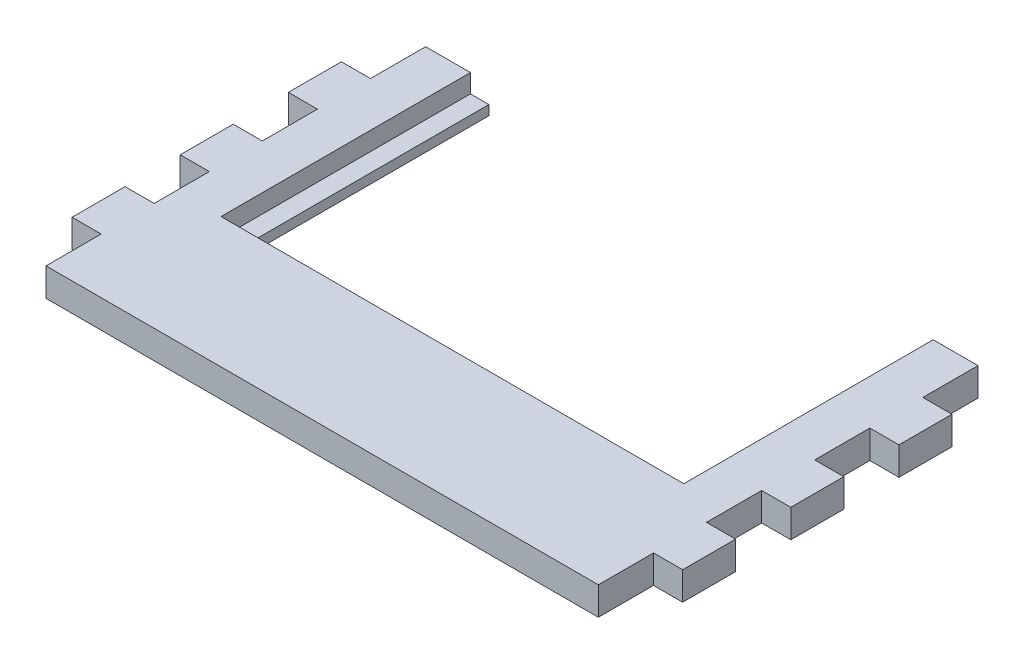
ISO-10303-21;
HEADER;
FILE_DESCRIPTION(('STEP AP214'),'2;1');
FILE_NAME('part.step','',(''),(''),'','','');
FILE_SCHEMA(('AUTOMOTIVE_DESIGN { 1 0 10303 214 1 1 1 1 }'));
ENDSEC;
DATA;
#1=APPLICATION_CONTEXT('core data for automotive mechanical design processes');
#2=APPLICATION_PROTOCOL_DEFINITION('international standard','automotive_design',2000,#1);
#3=PRODUCT_CONTEXT('',#1,'mechanical');
#4=PRODUCT('Part','Part','',(#3));
#5=PRODUCT_RELATED_PRODUCT_CATEGORY('part','',(#4));
#6=PRODUCT_DEFINITION_FORMATION('','',#4);
#7=PRODUCT_DEFINITION_CONTEXT('part definition',#1,'design');
#8=PRODUCT_DEFINITION('design','',#6,#7);
#9=PRODUCT_DEFINITION_SHAPE('','',#8);
#10=(LENGTH_UNIT() NAMED_UNIT(*) SI_UNIT(.MILLI.,.METRE.));
#11=(NAMED_UNIT(*) PLANE_ANGLE_UNIT() SI_UNIT($,.RADIAN.));
#12=(NAMED_UNIT(*) SI_UNIT($,.STERADIAN.) SOLID_ANGLE_UNIT());
#13=UNCERTAINTY_MEASURE_WITH_UNIT(LENGTH_MEASURE(1.E-05),#10,'distance_accuracy_value','');
#14=(GEOMETRIC_REPRESENTATION_CONTEXT(3) GLOBAL_UNCERTAINTY_ASSIGNED_CONTEXT((#13)) GLOBAL_UNIT_ASSIGNED_CONTEXT((#10,
#11,#12)) REPRESENTATION_CONTEXT('',''));
#15=CARTESIAN_POINT('',(0.,0.,0.));
#16=DIRECTION('',(0.,0.,1.));
#17=DIRECTION('',(1.,0.,0.));
#18=AXIS2_PLACEMENT_3D('',#15,#16,#17);
#19=CARTESIAN_POINT('',(0.,15.25,-185.313864628821));
#20=DIRECTION('',(0.,0.,-1.));
#21=DIRECTION('',(-1.,0.,0.));
#22=AXIS2_PLACEMENT_3D('',#19,#20,#21);
#23=PLANE('',#22);
#24=DIRECTION('',(1.,0.,0.));
#25=VECTOR('',#24,1.);
#26=CARTESIAN_POINT('',(0.,15.25,-185.313864628821));
#27=LINE('',#26,#25);
#28=CARTESIAN_POINT('',(127.414847161572,15.25,-185.313864628821));
#29=VERTEX_POINT('',#28);
#30=CARTESIAN_POINT('',(151.664847161572,15.25,-185.313864628821));
#31=VERTEX_POINT('',#30);
#32=EDGE_CURVE('E294',#29,#31,#27,.T.);
#33=ORIENTED_EDGE('',*,*,#32,.T.);
#34=DIRECTION('',(0.,1.,0.));
#35=VECTOR('',#34,1.);
#36=CARTESIAN_POINT('',(151.664847161572,-0.000999999999999265,-185.313864628821));
#37=LINE('',#36,#35);
#38=CARTESIAN_POINT('',(151.664847161572,0.,-185.313864628821));
#39=VERTEX_POINT('',#38);
#40=EDGE_CURVE('E530',#39,#31,#37,.T.);
#41=ORIENTED_EDGE('',*,*,#40,.F.);
#42=DIRECTION('',(1.,0.,0.));
#43=VECTOR('',#42,1.);
#44=CARTESIAN_POINT('',(0.,0.,-185.313864628821));
#45=LINE('',#44,#43);
#46=CARTESIAN_POINT('',(117.414847161572,0.,-185.313864628821));
#47=VERTEX_POINT('',#46);
#48=EDGE_CURVE('E331',#47,#39,#45,.T.);
#49=ORIENTED_EDGE('',*,*,#48,.F.);
#50=DIRECTION('',(0.,-1.,0.));
#51=VECTOR('',#50,1.);
#52=CARTESIAN_POINT('',(117.414847161572,15.25,-185.313864628821));
#53=LINE('',#52,#51);
#54=CARTESIAN_POINT('',(117.414847161572,5.25,-185.313864628821));
#55=VERTEX_POINT('',#54);
#56=EDGE_CURVE('E11',#55,#47,#53,.T.);
#57=ORIENTED_EDGE('',*,*,#56,.F.);
#58=DIRECTION('',(-1.,0.,0.));
#59=VECTOR('',#58,1.);
#60=CARTESIAN_POINT('',(-123.085152838428,5.25,-185.313864628821));
#61=LINE('',#60,#59);
#62=CARTESIAN_POINT('',(127.414847161572,5.25,-185.313864628821));
#63=VERTEX_POINT('',#62);
#64=EDGE_CURVE('E359',#63,#55,#61,.T.);
#65=ORIENTED_EDGE('',*,*,#64,.F.);
#66=DIRECTION('',(0.,1.,0.));
#67=VECTOR('',#66,1.);
#68=CARTESIAN_POINT('',(127.414847161572,5.25,-185.313864628821));
#69=LINE('',#68,#67);
#70=EDGE_CURVE('E361',#63,#29,#69,.T.);
#71=ORIENTED_EDGE('',*,*,#70,.T.);
#72=EDGE_LOOP('',(#33,#41,#49,#57,#65,#71));
#73=FACE_BOUND('',#72,.T.);
#74=ADVANCED_FACE('F38',(#73),#23,.T.);
#75=CARTESIAN_POINT('',(0.,15.25,20.1861353711791));
#76=DIRECTION('',(0.,0.,-1.));
#77=DIRECTION('',(-1.,0.,0.));
#78=AXIS2_PLACEMENT_3D('',#75,#76,#77);
#79=PLANE('',#78);
#80=DIRECTION('',(0.,1.,0.));
#81=VECTOR('',#80,1.);
#82=CARTESIAN_POINT('',(151.664847161572,-0.000999999999999265,20.186135371179));
#83=LINE('',#82,#81);
#84=CARTESIAN_POINT('',(151.664847161572,0.,20.1861353711791));
#85=VERTEX_POINT('',#84);
#86=CARTESIAN_POINT('',(151.664847161572,15.25,20.186135371179));
#87=VERTEX_POINT('',#86);
#88=EDGE_CURVE('E466',#85,#87,#83,.T.);
#89=ORIENTED_EDGE('',*,*,#88,.T.);
#90=DIRECTION('',(1.,0.,0.));
#91=VECTOR('',#90,1.);
#92=CARTESIAN_POINT('',(0.,15.25,20.1861353711791));
#93=LINE('',#92,#91);
#94=CARTESIAN_POINT('',(-147.335152838428,15.25,20.1861353711791));
#95=VERTEX_POINT('',#94);
#96=EDGE_CURVE('E338',#95,#87,#93,.T.);
#97=ORIENTED_EDGE('',*,*,#96,.F.);
#98=DIRECTION('',(0.,1.,0.));
#99=VECTOR('',#98,1.);
#100=CARTESIAN_POINT('',(-147.335152838428,-0.000999999999999265,20.1861353711791));
#101=LINE('',#100,#99);
#102=CARTESIAN_POINT('',(-147.335152838428,0.,20.1861353711791));
#103=VERTEX_POINT('',#102);
#104=EDGE_CURVE('E385',#103,#95,#101,.T.);
#105=ORIENTED_EDGE('',*,*,#104,.F.);
#106=DIRECTION('',(1.,0.,0.));
#107=VECTOR('',#106,1.);
#108=CARTESIAN_POINT('',(0.,0.,20.1861353711791));
#109=LINE('',#108,#107);
#110=EDGE_CURVE('E305',#103,#85,#109,.T.);
#111=ORIENTED_EDGE('',*,*,#110,.T.);
#112=EDGE_LOOP('',(#89,#97,#105,#111));
#113=FACE_BOUND('',#112,.T.);
#114=ADVANCED_FACE('F622',(#113),#79,.F.);
#115=CARTESIAN_POINT('',(167.414847161572,15.25,0.));
#116=DIRECTION('',(1.,0.,0.));
#117=DIRECTION('',(0.,0.,-1.));
#118=AXIS2_PLACEMENT_3D('',#115,#116,#117);
#119=PLANE('',#118);
#120=DIRECTION('',(0.,0.,1.));
#121=VECTOR('',#120,1.);
#122=CARTESIAN_POINT('',(167.414847161572,0.,0.));
#123=LINE('',#122,#121);
#124=CARTESIAN_POINT('',(167.414847161572,0.,-155.456721771678));
#125=VERTEX_POINT('',#124);
#126=CARTESIAN_POINT('',(167.414847161572,0.,-126.766245581202));
#127=VERTEX_POINT('',#126);
#128=EDGE_CURVE('E286',#125,#127,#123,.T.);
#129=ORIENTED_EDGE('',*,*,#128,.F.);
#130=DIRECTION('',(0.,1.,0.));
#131=VECTOR('',#130,1.);
#132=CARTESIAN_POINT('',(167.414847161572,-0.000999999999999265,-155.456721771678));
#133=LINE('',#132,#131);
#134=CARTESIAN_POINT('',(167.414847161572,15.25,-155.456721771678));
#135=VERTEX_POINT('',#134);
#136=EDGE_CURVE('E269',#125,#135,#133,.T.);
#137=ORIENTED_EDGE('',*,*,#136,.T.);
#138=DIRECTION('',(0.,0.,1.));
#139=VECTOR('',#138,1.);
#140=CARTESIAN_POINT('',(167.414847161572,15.25,0.));
#141=LINE('',#140,#139);
#142=CARTESIAN_POINT('',(167.414847161572,15.25,-126.766245581202));
#143=VERTEX_POINT('',#142);
#144=EDGE_CURVE('E339',#135,#143,#141,.T.);
#145=ORIENTED_EDGE('',*,*,#144,.T.);
#146=DIRECTION('',(0.,1.,0.));
#147=VECTOR('',#146,1.);
#148=CARTESIAN_POINT('',(167.414847161572,-0.000999999999999265,-126.766245581202));
#149=LINE('',#148,#147);
#150=EDGE_CURVE('E293',#127,#143,#149,.T.);
#151=ORIENTED_EDGE('',*,*,#150,.F.);
#152=EDGE_LOOP('',(#129,#137,#145,#151));
#153=FACE_BOUND('',#152,.T.);
#154=ADVANCED_FACE('F292',(#153),#119,.T.);
#155=CARTESIAN_POINT('',(167.414847161572,0.,-96.9091027240591));
#156=VERTEX_POINT('',#155);
#157=CARTESIAN_POINT('',(167.414847161572,0.,-68.2186265335829));
#158=VERTEX_POINT('',#157);
#159=EDGE_CURVE('E295',#156,#158,#123,.T.);
#160=ORIENTED_EDGE('',*,*,#159,.F.);
#161=DIRECTION('',(0.,1.,0.));
#162=VECTOR('',#161,1.);
#163=CARTESIAN_POINT('',(167.414847161572,-0.000999999999999265,-96.9091027240591));
#164=LINE('',#163,#162);
#165=CARTESIAN_POINT('',(167.414847161572,15.25,-96.9091027240591));
#166=VERTEX_POINT('',#165);
#167=EDGE_CURVE('E509',#156,#166,#164,.T.);
#168=ORIENTED_EDGE('',*,*,#167,.T.);
#169=CARTESIAN_POINT('',(167.414847161572,15.25,-68.2186265335829));
#170=VERTEX_POINT('',#169);
#171=EDGE_CURVE('E337',#166,#170,#141,.T.);
#172=ORIENTED_EDGE('',*,*,#171,.T.);
#173=DIRECTION('',(0.,1.,0.));
#174=VECTOR('',#173,1.);
#175=CARTESIAN_POINT('',(167.414847161572,-0.000999999999999265,-68.2186265335829));
#176=LINE('',#175,#174);
#177=EDGE_CURVE('E486',#158,#170,#176,.T.);
#178=ORIENTED_EDGE('',*,*,#177,.F.);
#179=EDGE_LOOP('',(#160,#168,#172,#178));
#180=FACE_BOUND('',#179,.T.);
#181=ADVANCED_FACE('F648',(#180),#119,.T.);
#182=CARTESIAN_POINT('',(167.414847161572,0.,-38.36148367644));
#183=VERTEX_POINT('',#182);
#184=CARTESIAN_POINT('',(167.414847161572,0.,-9.67100748596383));
#185=VERTEX_POINT('',#184);
#186=EDGE_CURVE('E297',#183,#185,#123,.T.);
#187=ORIENTED_EDGE('',*,*,#186,.F.);
#188=DIRECTION('',(0.,1.,0.));
#189=VECTOR('',#188,1.);
#190=CARTESIAN_POINT('',(167.414847161572,-0.000999999999999265,-38.36148367644));
#191=LINE('',#190,#189);
#192=CARTESIAN_POINT('',(167.414847161572,15.25,-38.36148367644));
#193=VERTEX_POINT('',#192);
#194=EDGE_CURVE('E485',#183,#193,#191,.T.);
#195=ORIENTED_EDGE('',*,*,#194,.T.);
#196=CARTESIAN_POINT('',(167.414847161572,15.25,-9.67100748596383));
#197=VERTEX_POINT('',#196);
#198=EDGE_CURVE('E334',#193,#197,#141,.T.);
#199=ORIENTED_EDGE('',*,*,#198,.T.);
#200=DIRECTION('',(0.,1.,0.));
#201=VECTOR('',#200,1.);
#202=CARTESIAN_POINT('',(167.414847161572,-0.000999999999999265,-9.67100748596383));
#203=LINE('',#202,#201);
#204=EDGE_CURVE('E467',#185,#197,#203,.T.);
#205=ORIENTED_EDGE('',*,*,#204,.F.);
#206=EDGE_LOOP('',(#187,#195,#199,#205));
#207=FACE_BOUND('',#206,.T.);
#208=ADVANCED_FACE('F632',(#207),#119,.T.);
#209=CARTESIAN_POINT('',(0.,15.25,0.));
#210=DIRECTION('',(0.,1.,0.));
#211=DIRECTION('',(0.,0.,1.));
#212=AXIS2_PLACEMENT_3D('',#209,#210,#211);
#213=PLANE('',#212);
#214=ORIENTED_EDGE('',*,*,#144,.F.);
#215=DIRECTION('',(-1.,0.,0.));
#216=VECTOR('',#215,1.);
#217=CARTESIAN_POINT('',(167.414847161572,15.25,-155.456721771678));
#218=LINE('',#217,#216);
#219=CARTESIAN_POINT('',(151.664847161572,15.25,-155.456721771678));
#220=VERTEX_POINT('',#219);
#221=EDGE_CURVE('E275',#135,#220,#218,.T.);
#222=ORIENTED_EDGE('',*,*,#221,.T.);
#223=DIRECTION('',(0.,0.,-1.));
#224=VECTOR('',#223,1.);
#225=CARTESIAN_POINT('',(151.664847161572,15.25,-185.313864628821));
#226=LINE('',#225,#224);
#227=EDGE_CURVE('E289',#220,#31,#226,.T.);
#228=ORIENTED_EDGE('',*,*,#227,.T.);
#229=ORIENTED_EDGE('',*,*,#32,.F.);
#230=DIRECTION('',(0.,0.,-1.));
#231=VECTOR('',#230,1.);
#232=CARTESIAN_POINT('',(127.414847161572,15.25,-185.313864628821));
#233=LINE('',#232,#231);
#234=CARTESIAN_POINT('',(127.414847161572,15.25,-50.313864628821));
#235=VERTEX_POINT('',#234);
#236=EDGE_CURVE('E366',#235,#29,#233,.T.);
#237=ORIENTED_EDGE('',*,*,#236,.F.);
#238=DIRECTION('',(1.,0.,0.));
#239=VECTOR('',#238,1.);
#240=CARTESIAN_POINT('',(-123.085152838428,15.25,-50.3138646288209));
#241=LINE('',#240,#239);
#242=CARTESIAN_POINT('',(-123.085152838428,15.25,-50.3138646288209));
#243=VERTEX_POINT('',#242);
#244=EDGE_CURVE('E369',#243,#235,#241,.T.);
#245=ORIENTED_EDGE('',*,*,#244,.F.);
#246=DIRECTION('',(0.,0.,1.));
#247=VECTOR('',#246,1.);
#248=CARTESIAN_POINT('',(-123.085152838428,15.25,-185.313864628821));
#249=LINE('',#248,#247);
#250=CARTESIAN_POINT('',(-123.085152838428,15.25,-185.313864628821));
#251=VERTEX_POINT('',#250);
#252=EDGE_CURVE('E372',#251,#243,#249,.T.);
#253=ORIENTED_EDGE('',*,*,#252,.F.);
#254=CARTESIAN_POINT('',(-147.335152838428,15.25,-185.313864628821));
#255=VERTEX_POINT('',#254);
#256=EDGE_CURVE('E299',#255,#251,#27,.T.);
#257=ORIENTED_EDGE('',*,*,#256,.F.);
#258=DIRECTION('',(0.,0.,-1.));
#259=VECTOR('',#258,1.);
#260=CARTESIAN_POINT('',(-147.335152838428,15.25,-185.313864628821));
#261=LINE('',#260,#259);
#262=CARTESIAN_POINT('',(-147.335152838428,15.25,-155.456721771678));
#263=VERTEX_POINT('',#262);
#264=EDGE_CURVE('E454',#263,#255,#261,.T.);
#265=ORIENTED_EDGE('',*,*,#264,.F.);
#266=DIRECTION('',(1.,0.,0.));
#267=VECTOR('',#266,1.);
#268=CARTESIAN_POINT('',(-163.085152838428,15.25,-155.456721771678));
#269=LINE('',#268,#267);
#270=CARTESIAN_POINT('',(-163.085152838428,15.25,-155.456721771678));
#271=VERTEX_POINT('',#270);
#272=EDGE_CURVE('E459',#271,#263,#269,.T.);
#273=ORIENTED_EDGE('',*,*,#272,.F.);
#274=DIRECTION('',(0.,0.,1.));
#275=VECTOR('',#274,1.);
#276=CARTESIAN_POINT('',(-163.085152838428,15.25,0.));
#277=LINE('',#276,#275);
#278=CARTESIAN_POINT('',(-163.085152838428,15.25,-126.766245581202));
#279=VERTEX_POINT('',#278);
#280=EDGE_CURVE('E342',#271,#279,#277,.T.);
#281=ORIENTED_EDGE('',*,*,#280,.T.);
#282=DIRECTION('',(-1.,0.,0.));
#283=VECTOR('',#282,1.);
#284=CARTESIAN_POINT('',(-163.085152838428,15.25,-126.766245581202));
#285=LINE('',#284,#283);
#286=CARTESIAN_POINT('',(-147.335152838428,15.25,-126.766245581202));
#287=VERTEX_POINT('',#286);
#288=EDGE_CURVE('E432',#287,#279,#285,.T.);
#289=ORIENTED_EDGE('',*,*,#288,.F.);
#290=DIRECTION('',(0.,0.,-1.));
#291=VECTOR('',#290,1.);
#292=CARTESIAN_POINT('',(-147.335152838428,15.25,-126.766245581202));
#293=LINE('',#292,#291);
#294=CARTESIAN_POINT('',(-147.335152838428,15.25,-96.9091027240591));
#295=VERTEX_POINT('',#294);
#296=EDGE_CURVE('E439',#295,#287,#293,.T.);
#297=ORIENTED_EDGE('',*,*,#296,.F.);
#298=DIRECTION('',(1.,0.,0.));
#299=VECTOR('',#298,1.);
#300=CARTESIAN_POINT('',(-163.085152838428,15.25,-96.9091027240591));
#301=LINE('',#300,#299);
#302=CARTESIAN_POINT('',(-163.085152838428,15.25,-96.9091027240591));
#303=VERTEX_POINT('',#302);
#304=EDGE_CURVE('E442',#303,#295,#301,.T.);
#305=ORIENTED_EDGE('',*,*,#304,.F.);
#306=CARTESIAN_POINT('',(-163.085152838428,15.25,-68.2186265335828));
#307=VERTEX_POINT('',#306);
#308=EDGE_CURVE('E345',#303,#307,#277,.T.);
#309=ORIENTED_EDGE('',*,*,#308,.T.);
#310=DIRECTION('',(-1.,0.,0.));
#311=VECTOR('',#310,1.);
#312=CARTESIAN_POINT('',(-163.085152838428,15.25,-68.2186265335828));
#313=LINE('',#312,#311);
#314=CARTESIAN_POINT('',(-147.335152838428,15.25,-68.2186265335828));
#315=VERTEX_POINT('',#314);
#316=EDGE_CURVE('E408',#315,#307,#313,.T.);
#317=ORIENTED_EDGE('',*,*,#316,.F.);
#318=DIRECTION('',(0.,0.,-1.));
#319=VECTOR('',#318,1.);
#320=CARTESIAN_POINT('',(-147.335152838428,15.25,-68.2186265335828));
#321=LINE('',#320,#319);
#322=CARTESIAN_POINT('',(-147.335152838428,15.25,-38.36148367644));
#323=VERTEX_POINT('',#322);
#324=EDGE_CURVE('E415',#323,#315,#321,.T.);
#325=ORIENTED_EDGE('',*,*,#324,.F.);
#326=DIRECTION('',(1.,0.,0.));
#327=VECTOR('',#326,1.);
#328=CARTESIAN_POINT('',(-163.085152838428,15.25,-38.36148367644));
#329=LINE('',#328,#327);
#330=CARTESIAN_POINT('',(-163.085152838428,15.25,-38.36148367644));
#331=VERTEX_POINT('',#330);
#332=EDGE_CURVE('E418',#331,#323,#329,.T.);
#333=ORIENTED_EDGE('',*,*,#332,.F.);
#334=CARTESIAN_POINT('',(-163.085152838428,15.25,-9.67100748596383));
#335=VERTEX_POINT('',#334);
#336=EDGE_CURVE('E343',#331,#335,#277,.T.);
#337=ORIENTED_EDGE('',*,*,#336,.T.);
#338=DIRECTION('',(-1.,0.,0.));
#339=VECTOR('',#338,1.);
#340=CARTESIAN_POINT('',(-163.085152838428,15.25,-9.67100748596383));
#341=LINE('',#340,#339);
#342=CARTESIAN_POINT('',(-147.335152838428,15.25,-9.67100748596383));
#343=VERTEX_POINT('',#342);
#344=EDGE_CURVE('E388',#343,#335,#341,.T.);
#345=ORIENTED_EDGE('',*,*,#344,.F.);
#346=DIRECTION('',(0.,0.,-1.));
#347=VECTOR('',#346,1.);
#348=CARTESIAN_POINT('',(-147.335152838428,15.25,-9.67100748596383));
#349=LINE('',#348,#347);
#350=EDGE_CURVE('E395',#95,#343,#349,.T.);
#351=ORIENTED_EDGE('',*,*,#350,.F.);
#352=ORIENTED_EDGE('',*,*,#96,.T.);
#353=DIRECTION('',(0.,0.,-1.));
#354=VECTOR('',#353,1.);
#355=CARTESIAN_POINT('',(151.664847161572,15.25,-9.67100748596383));
#356=LINE('',#355,#354);
#357=CARTESIAN_POINT('',(151.664847161572,15.25,-9.67100748596383));
#358=VERTEX_POINT('',#357);
#359=EDGE_CURVE('E470',#87,#358,#356,.T.);
#360=ORIENTED_EDGE('',*,*,#359,.T.);
#361=DIRECTION('',(1.,0.,0.));
#362=VECTOR('',#361,1.);
#363=CARTESIAN_POINT('',(167.414847161572,15.25,-9.67100748596383));
#364=LINE('',#363,#362);
#365=EDGE_CURVE('E475',#358,#197,#364,.T.);
#366=ORIENTED_EDGE('',*,*,#365,.T.);
#367=ORIENTED_EDGE('',*,*,#198,.F.);
#368=DIRECTION('',(-1.,0.,0.));
#369=VECTOR('',#368,1.);
#370=CARTESIAN_POINT('',(167.414847161572,15.25,-38.36148367644));
#371=LINE('',#370,#369);
#372=CARTESIAN_POINT('',(151.664847161572,15.25,-38.36148367644));
#373=VERTEX_POINT('',#372);
#374=EDGE_CURVE('E489',#193,#373,#371,.T.);
#375=ORIENTED_EDGE('',*,*,#374,.T.);
#376=DIRECTION('',(0.,0.,-1.));
#377=VECTOR('',#376,1.);
#378=CARTESIAN_POINT('',(151.664847161572,15.25,-68.2186265335829));
#379=LINE('',#378,#377);
#380=CARTESIAN_POINT('',(151.664847161572,15.25,-68.2186265335829));
#381=VERTEX_POINT('',#380);
#382=EDGE_CURVE('E497',#373,#381,#379,.T.);
#383=ORIENTED_EDGE('',*,*,#382,.T.);
#384=DIRECTION('',(1.,0.,0.));
#385=VECTOR('',#384,1.);
#386=CARTESIAN_POINT('',(167.414847161572,15.25,-68.2186265335829));
#387=LINE('',#386,#385);
#388=EDGE_CURVE('E500',#381,#170,#387,.T.);
#389=ORIENTED_EDGE('',*,*,#388,.T.);
#390=ORIENTED_EDGE('',*,*,#171,.F.);
#391=DIRECTION('',(-1.,0.,0.));
#392=VECTOR('',#391,1.);
#393=CARTESIAN_POINT('',(167.414847161572,15.25,-96.9091027240591));
#394=LINE('',#393,#392);
#395=CARTESIAN_POINT('',(151.664847161572,15.25,-96.9091027240591));
#396=VERTEX_POINT('',#395);
#397=EDGE_CURVE('E511',#166,#396,#394,.T.);
#398=ORIENTED_EDGE('',*,*,#397,.T.);
#399=DIRECTION('',(0.,0.,-1.));
#400=VECTOR('',#399,1.);
#401=CARTESIAN_POINT('',(151.664847161572,15.25,-126.766245581202));
#402=LINE('',#401,#400);
#403=CARTESIAN_POINT('',(151.664847161572,15.25,-126.766245581202));
#404=VERTEX_POINT('',#403);
#405=EDGE_CURVE('E519',#396,#404,#402,.T.);
#406=ORIENTED_EDGE('',*,*,#405,.T.);
#407=DIRECTION('',(1.,0.,0.));
#408=VECTOR('',#407,1.);
#409=CARTESIAN_POINT('',(167.414847161572,15.25,-126.766245581202));
#410=LINE('',#409,#408);
#411=EDGE_CURVE('E522',#404,#143,#410,.T.);
#412=ORIENTED_EDGE('',*,*,#411,.T.);
#413=EDGE_LOOP('',(#214,#222,#228,#229,#237,#245,#253,#257,#265,#273,#281,#289,#297,#305,#309,
#317,#325,#333,#337,#345,#351,#352,#360,#366,#367,#375,#383,#389,#390,#398,#406,#412));
#414=FACE_BOUND('',#413,.T.);
#415=ADVANCED_FACE('F538',(#414),#213,.T.);
#416=CARTESIAN_POINT('',(0.,0.,0.));
#417=DIRECTION('',(0.,1.,0.));
#418=DIRECTION('',(0.,0.,1.));
#419=AXIS2_PLACEMENT_3D('',#416,#417,#418);
#420=PLANE('',#419);
#421=DIRECTION('',(1.,0.,0.));
#422=VECTOR('',#421,1.);
#423=CARTESIAN_POINT('',(167.414847161572,0.,-155.456721771678));
#424=LINE('',#423,#422);
#425=CARTESIAN_POINT('',(151.664847161572,0.,-155.456721771678));
#426=VERTEX_POINT('',#425);
#427=EDGE_CURVE('E272',#426,#125,#424,.T.);
#428=ORIENTED_EDGE('',*,*,#427,.T.);
#429=ORIENTED_EDGE('',*,*,#128,.T.);
#430=DIRECTION('',(-1.,0.,0.));
#431=VECTOR('',#430,1.);
#432=CARTESIAN_POINT('',(167.414847161572,0.,-126.766245581202));
#433=LINE('',#432,#431);
#434=CARTESIAN_POINT('',(151.664847161572,0.,-126.766245581202));
#435=VERTEX_POINT('',#434);
#436=EDGE_CURVE('E507',#127,#435,#433,.T.);
#437=ORIENTED_EDGE('',*,*,#436,.T.);
#438=DIRECTION('',(0.,0.,1.));
#439=VECTOR('',#438,1.);
#440=CARTESIAN_POINT('',(151.664847161572,0.,-126.766245581202));
#441=LINE('',#440,#439);
#442=CARTESIAN_POINT('',(151.664847161572,0.,-96.9091027240591));
#443=VERTEX_POINT('',#442);
#444=EDGE_CURVE('E484',#435,#443,#441,.T.);
#445=ORIENTED_EDGE('',*,*,#444,.T.);
#446=DIRECTION('',(1.,0.,0.));
#447=VECTOR('',#446,1.);
#448=CARTESIAN_POINT('',(167.414847161572,0.,-96.9091027240591));
#449=LINE('',#448,#447);
#450=EDGE_CURVE('E525',#443,#156,#449,.T.);
#451=ORIENTED_EDGE('',*,*,#450,.T.);
#452=ORIENTED_EDGE('',*,*,#159,.T.);
#453=DIRECTION('',(-1.,0.,0.));
#454=VECTOR('',#453,1.);
#455=CARTESIAN_POINT('',(167.414847161572,0.,-68.2186265335829));
#456=LINE('',#455,#454);
#457=CARTESIAN_POINT('',(151.664847161572,0.,-68.2186265335829));
#458=VERTEX_POINT('',#457);
#459=EDGE_CURVE('E481',#158,#458,#456,.T.);
#460=ORIENTED_EDGE('',*,*,#459,.T.);
#461=DIRECTION('',(0.,0.,1.));
#462=VECTOR('',#461,1.);
#463=CARTESIAN_POINT('',(151.664847161572,0.,-68.2186265335829));
#464=LINE('',#463,#462);
#465=CARTESIAN_POINT('',(151.664847161572,0.,-38.36148367644));
#466=VERTEX_POINT('',#465);
#467=EDGE_CURVE('E465',#458,#466,#464,.T.);
#468=ORIENTED_EDGE('',*,*,#467,.T.);
#469=DIRECTION('',(1.,0.,0.));
#470=VECTOR('',#469,1.);
#471=CARTESIAN_POINT('',(167.414847161572,0.,-38.36148367644));
#472=LINE('',#471,#470);
#473=EDGE_CURVE('E503',#466,#183,#472,.T.);
#474=ORIENTED_EDGE('',*,*,#473,.T.);
#475=ORIENTED_EDGE('',*,*,#186,.T.);
#476=DIRECTION('',(-1.,0.,0.));
#477=VECTOR('',#476,1.);
#478=CARTESIAN_POINT('',(167.414847161572,0.,-9.67100748596383));
#479=LINE('',#478,#477);
#480=CARTESIAN_POINT('',(151.664847161572,0.,-9.67100748596383));
#481=VERTEX_POINT('',#480);
#482=EDGE_CURVE('E463',#185,#481,#479,.T.);
#483=ORIENTED_EDGE('',*,*,#482,.T.);
#484=DIRECTION('',(0.,0.,1.));
#485=VECTOR('',#484,1.);
#486=CARTESIAN_POINT('',(151.664847161572,0.,-9.67100748596383));
#487=LINE('',#486,#485);
#488=EDGE_CURVE('E478',#481,#85,#487,.T.);
#489=ORIENTED_EDGE('',*,*,#488,.T.);
#490=ORIENTED_EDGE('',*,*,#110,.F.);
#491=DIRECTION('',(0.,0.,1.));
#492=VECTOR('',#491,1.);
#493=CARTESIAN_POINT('',(-147.335152838428,0.,-9.67100748596383));
#494=LINE('',#493,#492);
#495=CARTESIAN_POINT('',(-147.335152838428,0.,-9.67100748596383));
#496=VERTEX_POINT('',#495);
#497=EDGE_CURVE('E280',#496,#103,#494,.T.);
#498=ORIENTED_EDGE('',*,*,#497,.F.);
#499=DIRECTION('',(1.,0.,0.));
#500=VECTOR('',#499,1.);
#501=CARTESIAN_POINT('',(-163.085152838428,0.,-9.67100748596383));
#502=LINE('',#501,#500);
#503=CARTESIAN_POINT('',(-163.085152838428,0.,-9.67100748596383));
#504=VERTEX_POINT('',#503);
#505=EDGE_CURVE('E398',#504,#496,#502,.T.);
#506=ORIENTED_EDGE('',*,*,#505,.F.);
#507=DIRECTION('',(0.,0.,1.));
#508=VECTOR('',#507,1.);
#509=CARTESIAN_POINT('',(-163.085152838428,0.,0.));
#510=LINE('',#509,#508);
#511=CARTESIAN_POINT('',(-163.085152838428,0.,-38.36148367644));
#512=VERTEX_POINT('',#511);
#513=EDGE_CURVE('E318',#512,#504,#510,.T.);
#514=ORIENTED_EDGE('',*,*,#513,.F.);
#515=DIRECTION('',(-1.,0.,0.));
#516=VECTOR('',#515,1.);
#517=CARTESIAN_POINT('',(-163.085152838428,0.,-38.36148367644));
#518=LINE('',#517,#516);
#519=CARTESIAN_POINT('',(-147.335152838428,0.,-38.36148367644));
#520=VERTEX_POINT('',#519);
#521=EDGE_CURVE('E401',#520,#512,#518,.T.);
#522=ORIENTED_EDGE('',*,*,#521,.F.);
#523=DIRECTION('',(0.,0.,1.));
#524=VECTOR('',#523,1.);
#525=CARTESIAN_POINT('',(-147.335152838428,0.,-68.2186265335828));
#526=LINE('',#525,#524);
#527=CARTESIAN_POINT('',(-147.335152838428,0.,-68.2186265335828));
#528=VERTEX_POINT('',#527);
#529=EDGE_CURVE('E393',#528,#520,#526,.T.);
#530=ORIENTED_EDGE('',*,*,#529,.F.);
#531=DIRECTION('',(1.,0.,0.));
#532=VECTOR('',#531,1.);
#533=CARTESIAN_POINT('',(-163.085152838428,0.,-68.2186265335828));
#534=LINE('',#533,#532);
#535=CARTESIAN_POINT('',(-163.085152838428,0.,-68.2186265335828));
#536=VERTEX_POINT('',#535);
#537=EDGE_CURVE('E421',#536,#528,#534,.T.);
#538=ORIENTED_EDGE('',*,*,#537,.F.);
#539=CARTESIAN_POINT('',(-163.085152838428,0.,-96.9091027240591));
#540=VERTEX_POINT('',#539);
#541=EDGE_CURVE('E316',#540,#536,#510,.T.);
#542=ORIENTED_EDGE('',*,*,#541,.F.);
#543=DIRECTION('',(-1.,0.,0.));
#544=VECTOR('',#543,1.);
#545=CARTESIAN_POINT('',(-163.085152838428,0.,-96.9091027240591));
#546=LINE('',#545,#544);
#547=CARTESIAN_POINT('',(-147.335152838428,0.,-96.9091027240591));
#548=VERTEX_POINT('',#547);
#549=EDGE_CURVE('E425',#548,#540,#546,.T.);
#550=ORIENTED_EDGE('',*,*,#549,.F.);
#551=DIRECTION('',(0.,0.,1.));
#552=VECTOR('',#551,1.);
#553=CARTESIAN_POINT('',(-147.335152838428,0.,-126.766245581202));
#554=LINE('',#553,#552);
#555=CARTESIAN_POINT('',(-147.335152838428,0.,-126.766245581202));
#556=VERTEX_POINT('',#555);
#557=EDGE_CURVE('E403',#556,#548,#554,.T.);
#558=ORIENTED_EDGE('',*,*,#557,.F.);
#559=DIRECTION('',(1.,0.,0.));
#560=VECTOR('',#559,1.);
#561=CARTESIAN_POINT('',(-163.085152838428,0.,-126.766245581202));
#562=LINE('',#561,#560);
#563=CARTESIAN_POINT('',(-163.085152838428,0.,-126.766245581202));
#564=VERTEX_POINT('',#563);
#565=EDGE_CURVE('E445',#564,#556,#562,.T.);
#566=ORIENTED_EDGE('',*,*,#565,.F.);
#567=CARTESIAN_POINT('',(-163.085152838428,0.,-155.456721771678));
#568=VERTEX_POINT('',#567);
#569=EDGE_CURVE('E310',#568,#564,#510,.T.);
#570=ORIENTED_EDGE('',*,*,#569,.F.);
#571=DIRECTION('',(-1.,0.,0.));
#572=VECTOR('',#571,1.);
#573=CARTESIAN_POINT('',(-163.085152838428,0.,-155.456721771678));
#574=LINE('',#573,#572);
#575=CARTESIAN_POINT('',(-147.335152838428,0.,-155.456721771678));
#576=VERTEX_POINT('',#575);
#577=EDGE_CURVE('E374',#576,#568,#574,.T.);
#578=ORIENTED_EDGE('',*,*,#577,.F.);
#579=DIRECTION('',(0.,0.,1.));
#580=VECTOR('',#579,1.);
#581=CARTESIAN_POINT('',(-147.335152838428,0.,-185.313864628821));
#582=LINE('',#581,#580);
#583=CARTESIAN_POINT('',(-147.335152838428,0.,-185.313864628821));
#584=VERTEX_POINT('',#583);
#585=EDGE_CURVE('E427',#584,#576,#582,.T.);
#586=ORIENTED_EDGE('',*,*,#585,.F.);
#587=CARTESIAN_POINT('',(-113.085152838428,0.,-185.313864628821));
#588=VERTEX_POINT('',#587);
#589=EDGE_CURVE('E321',#584,#588,#45,.T.);
#590=ORIENTED_EDGE('',*,*,#589,.T.);
#591=DIRECTION('',(0.,0.,1.));
#592=VECTOR('',#591,1.);
#593=CARTESIAN_POINT('',(-113.085152838428,0.,0.));
#594=LINE('',#593,#592);
#595=CARTESIAN_POINT('',(-113.085152838428,0.,-60.3138646288209));
#596=VERTEX_POINT('',#595);
#597=EDGE_CURVE('E322',#588,#596,#594,.T.);
#598=ORIENTED_EDGE('',*,*,#597,.T.);
#599=DIRECTION('',(1.,0.,0.));
#600=VECTOR('',#599,1.);
#601=CARTESIAN_POINT('',(0.,0.,-60.3138646288209));
#602=LINE('',#601,#600);
#603=CARTESIAN_POINT('',(117.414847161572,0.,-60.3138646288209));
#604=VERTEX_POINT('',#603);
#605=EDGE_CURVE('E325',#596,#604,#602,.T.);
#606=ORIENTED_EDGE('',*,*,#605,.T.);
#607=DIRECTION('',(0.,0.,1.));
#608=VECTOR('',#607,1.);
#609=CARTESIAN_POINT('',(117.414847161572,0.,0.));
#610=LINE('',#609,#608);
#611=EDGE_CURVE('E328',#47,#604,#610,.T.);
#612=ORIENTED_EDGE('',*,*,#611,.F.);
#613=ORIENTED_EDGE('',*,*,#48,.T.);
#614=DIRECTION('',(0.,0.,1.));
#615=VECTOR('',#614,1.);
#616=CARTESIAN_POINT('',(151.664847161572,0.,-185.313864628821));
#617=LINE('',#616,#615);
#618=EDGE_CURVE('E288',#39,#426,#617,.T.);
#619=ORIENTED_EDGE('',*,*,#618,.T.);
#620=EDGE_LOOP('',(#428,#429,#437,#445,#451,#452,#460,#468,#474,#475,#483,#489,#490,#498,#506,
#514,#522,#530,#538,#542,#550,#558,#566,#570,#578,#586,#590,#598,#606,#612,#613,#619));
#621=FACE_BOUND('',#620,.T.);
#622=ADVANCED_FACE('F284',(#621),#420,.F.);
#623=CARTESIAN_POINT('',(-163.085152838428,15.25,0.));
#624=DIRECTION('',(1.,0.,0.));
#625=DIRECTION('',(0.,0.,-1.));
#626=AXIS2_PLACEMENT_3D('',#623,#624,#625);
#627=PLANE('',#626);
#628=ORIENTED_EDGE('',*,*,#280,.F.);
#629=DIRECTION('',(0.,1.,0.));
#630=VECTOR('',#629,1.);
#631=CARTESIAN_POINT('',(-163.085152838428,-0.000999999999999265,-155.456721771678));
#632=LINE('',#631,#630);
#633=EDGE_CURVE('E451',#568,#271,#632,.T.);
#634=ORIENTED_EDGE('',*,*,#633,.F.);
#635=ORIENTED_EDGE('',*,*,#569,.T.);
#636=DIRECTION('',(0.,1.,0.));
#637=VECTOR('',#636,1.);
#638=CARTESIAN_POINT('',(-163.085152838428,-0.000999999999999265,-126.766245581202));
#639=LINE('',#638,#637);
#640=EDGE_CURVE('E428',#564,#279,#639,.T.);
#641=ORIENTED_EDGE('',*,*,#640,.T.);
#642=EDGE_LOOP('',(#628,#634,#635,#641));
#643=FACE_BOUND('',#642,.T.);
#644=ADVANCED_FACE('F581',(#643),#627,.F.);
#645=ORIENTED_EDGE('',*,*,#308,.F.);
#646=DIRECTION('',(0.,1.,0.));
#647=VECTOR('',#646,1.);
#648=CARTESIAN_POINT('',(-163.085152838428,-0.000999999999999265,-96.9091027240591));
#649=LINE('',#648,#647);
#650=EDGE_CURVE('E429',#540,#303,#649,.T.);
#651=ORIENTED_EDGE('',*,*,#650,.F.);
#652=ORIENTED_EDGE('',*,*,#541,.T.);
#653=DIRECTION('',(0.,1.,0.));
#654=VECTOR('',#653,1.);
#655=CARTESIAN_POINT('',(-163.085152838428,-0.000999999999999265,-68.2186265335828));
#656=LINE('',#655,#654);
#657=EDGE_CURVE('E404',#536,#307,#656,.T.);
#658=ORIENTED_EDGE('',*,*,#657,.T.);
#659=EDGE_LOOP('',(#645,#651,#652,#658));
#660=FACE_BOUND('',#659,.T.);
#661=ADVANCED_FACE('F592',(#660),#627,.F.);
#662=CARTESIAN_POINT('',(117.414847161572,15.25,0.));
#663=DIRECTION('',(1.,0.,0.));
#664=DIRECTION('',(0.,0.,-1.));
#665=AXIS2_PLACEMENT_3D('',#662,#663,#664);
#666=PLANE('',#665);
#667=DIRECTION('',(0.,0.,1.));
#668=VECTOR('',#667,1.);
#669=CARTESIAN_POINT('',(117.414847161572,5.25,0.));
#670=LINE('',#669,#668);
#671=CARTESIAN_POINT('',(117.414847161572,5.25,-60.3138646288209));
#672=VERTEX_POINT('',#671);
#673=EDGE_CURVE('E333',#55,#672,#670,.T.);
#674=ORIENTED_EDGE('',*,*,#673,.F.);
#675=ORIENTED_EDGE('',*,*,#56,.T.);
#676=ORIENTED_EDGE('',*,*,#611,.T.);
#677=DIRECTION('',(0.,-1.,0.));
#678=VECTOR('',#677,1.);
#679=CARTESIAN_POINT('',(117.414847161572,15.25,-60.3138646288209));
#680=LINE('',#679,#678);
#681=EDGE_CURVE('E46',#672,#604,#680,.T.);
#682=ORIENTED_EDGE('',*,*,#681,.F.);
#683=EDGE_LOOP('',(#674,#675,#676,#682));
#684=FACE_BOUND('',#683,.T.);
#685=ADVANCED_FACE('F40',(#684),#666,.F.);
#686=CARTESIAN_POINT('',(0.,15.25,-60.3138646288209));
#687=DIRECTION('',(0.,0.,-1.));
#688=DIRECTION('',(-1.,0.,0.));
#689=AXIS2_PLACEMENT_3D('',#686,#687,#688);
#690=PLANE('',#689);
#691=DIRECTION('',(0.,-1.,0.));
#692=VECTOR('',#691,1.);
#693=CARTESIAN_POINT('',(-113.085152838428,15.25,-60.3138646288209));
#694=LINE('',#693,#692);
#695=CARTESIAN_POINT('',(-113.085152838428,5.25,-60.3138646288209));
#696=VERTEX_POINT('',#695);
#697=EDGE_CURVE('E650',#696,#596,#694,.T.);
#698=ORIENTED_EDGE('',*,*,#697,.F.);
#699=DIRECTION('',(1.,0.,0.));
#700=VECTOR('',#699,1.);
#701=CARTESIAN_POINT('',(0.,5.25,-60.3138646288209));
#702=LINE('',#701,#700);
#703=EDGE_CURVE('E348',#696,#672,#702,.T.);
#704=ORIENTED_EDGE('',*,*,#703,.T.);
#705=ORIENTED_EDGE('',*,*,#681,.T.);
#706=ORIENTED_EDGE('',*,*,#605,.F.);
#707=EDGE_LOOP('',(#698,#704,#705,#706));
#708=FACE_BOUND('',#707,.T.);
#709=ADVANCED_FACE('F657',(#708),#690,.T.);
#710=CARTESIAN_POINT('',(-113.085152838428,15.25,0.));
#711=DIRECTION('',(1.,0.,0.));
#712=DIRECTION('',(0.,0.,-1.));
#713=AXIS2_PLACEMENT_3D('',#710,#711,#712);
#714=PLANE('',#713);
#715=DIRECTION('',(0.,-1.,0.));
#716=VECTOR('',#715,1.);
#717=CARTESIAN_POINT('',(-113.085152838428,15.25,-185.313864628821));
#718=LINE('',#717,#716);
#719=CARTESIAN_POINT('',(-113.085152838428,5.25,-185.313864628821));
#720=VERTEX_POINT('',#719);
#721=EDGE_CURVE('E649',#720,#588,#718,.T.);
#722=ORIENTED_EDGE('',*,*,#721,.F.);
#723=DIRECTION('',(0.,0.,1.));
#724=VECTOR('',#723,1.);
#725=CARTESIAN_POINT('',(-113.085152838428,5.25,0.));
#726=LINE('',#725,#724);
#727=EDGE_CURVE('E351',#720,#696,#726,.T.);
#728=ORIENTED_EDGE('',*,*,#727,.T.);
#729=ORIENTED_EDGE('',*,*,#697,.T.);
#730=ORIENTED_EDGE('',*,*,#597,.F.);
#731=EDGE_LOOP('',(#722,#728,#729,#730));
#732=FACE_BOUND('',#731,.T.);
#733=ADVANCED_FACE('F661',(#732),#714,.T.);
#734=DIRECTION('',(0.,1.,0.));
#735=VECTOR('',#734,1.);
#736=CARTESIAN_POINT('',(-147.335152838428,-0.000999999999999265,-185.313864628821));
#737=LINE('',#736,#735);
#738=EDGE_CURVE('E450',#584,#255,#737,.T.);
#739=ORIENTED_EDGE('',*,*,#738,.T.);
#740=ORIENTED_EDGE('',*,*,#256,.T.);
#741=DIRECTION('',(0.,1.,0.));
#742=VECTOR('',#741,1.);
#743=CARTESIAN_POINT('',(-123.085152838428,5.25,-185.313864628821));
#744=LINE('',#743,#742);
#745=CARTESIAN_POINT('',(-123.085152838428,5.25,-185.313864628821));
#746=VERTEX_POINT('',#745);
#747=EDGE_CURVE('E354',#746,#251,#744,.T.);
#748=ORIENTED_EDGE('',*,*,#747,.F.);
#749=EDGE_CURVE('E376',#720,#746,#61,.T.);
#750=ORIENTED_EDGE('',*,*,#749,.F.);
#751=ORIENTED_EDGE('',*,*,#721,.T.);
#752=ORIENTED_EDGE('',*,*,#589,.F.);
#753=EDGE_LOOP('',(#739,#740,#748,#750,#751,#752));
#754=FACE_BOUND('',#753,.T.);
#755=ADVANCED_FACE('F564',(#754),#23,.T.);
#756=ORIENTED_EDGE('',*,*,#336,.F.);
#757=DIRECTION('',(0.,1.,0.));
#758=VECTOR('',#757,1.);
#759=CARTESIAN_POINT('',(-163.085152838428,-0.000999999999999265,-38.36148367644));
#760=LINE('',#759,#758);
#761=EDGE_CURVE('E405',#512,#331,#760,.T.);
#762=ORIENTED_EDGE('',*,*,#761,.F.);
#763=ORIENTED_EDGE('',*,*,#513,.T.);
#764=DIRECTION('',(0.,1.,0.));
#765=VECTOR('',#764,1.);
#766=CARTESIAN_POINT('',(-163.085152838428,-0.000999999999999265,-9.67100748596383));
#767=LINE('',#766,#765);
#768=EDGE_CURVE('E390',#504,#335,#767,.T.);
#769=ORIENTED_EDGE('',*,*,#768,.T.);
#770=EDGE_LOOP('',(#756,#762,#763,#769));
#771=FACE_BOUND('',#770,.T.);
#772=ADVANCED_FACE('F612',(#771),#627,.F.);
#773=CARTESIAN_POINT('',(0.,5.25,0.));
#774=DIRECTION('',(0.,1.,0.));
#775=DIRECTION('',(0.,0.,1.));
#776=AXIS2_PLACEMENT_3D('',#773,#774,#775);
#777=PLANE('',#776);
#778=ORIENTED_EDGE('',*,*,#673,.T.);
#779=ORIENTED_EDGE('',*,*,#703,.F.);
#780=ORIENTED_EDGE('',*,*,#727,.F.);
#781=ORIENTED_EDGE('',*,*,#749,.T.);
#782=DIRECTION('',(0.,0.,1.));
#783=VECTOR('',#782,1.);
#784=CARTESIAN_POINT('',(-123.085152838428,5.25,-185.313864628821));
#785=LINE('',#784,#783);
#786=CARTESIAN_POINT('',(-123.085152838428,5.25,-50.3138646288209));
#787=VERTEX_POINT('',#786);
#788=EDGE_CURVE('E368',#746,#787,#785,.T.);
#789=ORIENTED_EDGE('',*,*,#788,.T.);
#790=DIRECTION('',(1.,0.,0.));
#791=VECTOR('',#790,1.);
#792=CARTESIAN_POINT('',(-123.085152838428,5.25,-50.3138646288209));
#793=LINE('',#792,#791);
#794=CARTESIAN_POINT('',(127.414847161572,5.25,-50.313864628821));
#795=VERTEX_POINT('',#794);
#796=EDGE_CURVE('E380',#787,#795,#793,.T.);
#797=ORIENTED_EDGE('',*,*,#796,.T.);
#798=DIRECTION('',(0.,0.,-1.));
#799=VECTOR('',#798,1.);
#800=CARTESIAN_POINT('',(127.414847161572,5.25,-185.313864628821));
#801=LINE('',#800,#799);
#802=EDGE_CURVE('E377',#795,#63,#801,.T.);
#803=ORIENTED_EDGE('',*,*,#802,.T.);
#804=ORIENTED_EDGE('',*,*,#64,.T.);
#805=EDGE_LOOP('',(#778,#779,#780,#781,#789,#797,#803,#804));
#806=FACE_BOUND('',#805,.T.);
#807=ADVANCED_FACE('F549',(#806),#777,.T.);
#808=CARTESIAN_POINT('',(-123.085152838428,5.25,-185.313864628821));
#809=DIRECTION('',(-1.,0.,0.));
#810=DIRECTION('',(0.,0.,1.));
#811=AXIS2_PLACEMENT_3D('',#808,#809,#810);
#812=PLANE('',#811);
#813=ORIENTED_EDGE('',*,*,#252,.T.);
#814=DIRECTION('',(0.,1.,0.));
#815=VECTOR('',#814,1.);
#816=CARTESIAN_POINT('',(-123.085152838428,5.25,-50.3138646288209));
#817=LINE('',#816,#815);
#818=EDGE_CURVE('E355',#787,#243,#817,.T.);
#819=ORIENTED_EDGE('',*,*,#818,.F.);
#820=ORIENTED_EDGE('',*,*,#788,.F.);
#821=ORIENTED_EDGE('',*,*,#747,.T.);
#822=EDGE_LOOP('',(#813,#819,#820,#821));
#823=FACE_BOUND('',#822,.T.);
#824=ADVANCED_FACE('F560',(#823),#812,.F.);
#825=CARTESIAN_POINT('',(127.414847161572,5.25,-185.313864628821));
#826=DIRECTION('',(1.,0.,0.));
#827=DIRECTION('',(0.,0.,-1.));
#828=AXIS2_PLACEMENT_3D('',#825,#826,#827);
#829=PLANE('',#828);
#830=ORIENTED_EDGE('',*,*,#236,.T.);
#831=ORIENTED_EDGE('',*,*,#70,.F.);
#832=ORIENTED_EDGE('',*,*,#802,.F.);
#833=DIRECTION('',(0.,1.,0.));
#834=VECTOR('',#833,1.);
#835=CARTESIAN_POINT('',(127.414847161572,5.25,-50.313864628821));
#836=LINE('',#835,#834);
#837=EDGE_CURVE('E358',#795,#235,#836,.T.);
#838=ORIENTED_EDGE('',*,*,#837,.T.);
#839=EDGE_LOOP('',(#830,#831,#832,#838));
#840=FACE_BOUND('',#839,.T.);
#841=ADVANCED_FACE('F547',(#840),#829,.F.);
#842=CARTESIAN_POINT('',(-123.085152838428,5.25,-50.3138646288209));
#843=DIRECTION('',(0.,0.,1.));
#844=DIRECTION('',(1.,0.,0.));
#845=AXIS2_PLACEMENT_3D('',#842,#843,#844);
#846=PLANE('',#845);
#847=ORIENTED_EDGE('',*,*,#244,.T.);
#848=ORIENTED_EDGE('',*,*,#837,.F.);
#849=ORIENTED_EDGE('',*,*,#796,.F.);
#850=ORIENTED_EDGE('',*,*,#818,.T.);
#851=EDGE_LOOP('',(#847,#848,#849,#850));
#852=FACE_BOUND('',#851,.T.);
#853=ADVANCED_FACE('F554',(#852),#846,.F.);
#854=CARTESIAN_POINT('',(-163.085152838428,-0.000999999999999265,-9.67100748596383));
#855=DIRECTION('',(0.,0.,-1.));
#856=DIRECTION('',(-1.,0.,0.));
#857=AXIS2_PLACEMENT_3D('',#854,#855,#856);
#858=PLANE('',#857);
#859=ORIENTED_EDGE('',*,*,#505,.T.);
#860=DIRECTION('',(0.,1.,0.));
#861=VECTOR('',#860,1.);
#862=CARTESIAN_POINT('',(-147.335152838428,-0.000999999999999265,-9.67100748596383));
#863=LINE('',#862,#861);
#864=EDGE_CURVE('E387',#496,#343,#863,.T.);
#865=ORIENTED_EDGE('',*,*,#864,.T.);
#866=ORIENTED_EDGE('',*,*,#344,.T.);
#867=ORIENTED_EDGE('',*,*,#768,.F.);
#868=EDGE_LOOP('',(#859,#865,#866,#867));
#869=FACE_BOUND('',#868,.T.);
#870=ADVANCED_FACE('F615',(#869),#858,.F.);
#871=CARTESIAN_POINT('',(-147.335152838428,-0.000999999999999265,-9.67100748596383));
#872=DIRECTION('',(1.,0.,0.));
#873=DIRECTION('',(0.,0.,-1.));
#874=AXIS2_PLACEMENT_3D('',#871,#872,#873);
#875=PLANE('',#874);
#876=ORIENTED_EDGE('',*,*,#497,.T.);
#877=ORIENTED_EDGE('',*,*,#104,.T.);
#878=ORIENTED_EDGE('',*,*,#350,.T.);
#879=ORIENTED_EDGE('',*,*,#864,.F.);
#880=EDGE_LOOP('',(#876,#877,#878,#879));
#881=FACE_BOUND('',#880,.T.);
#882=ADVANCED_FACE('F619',(#881),#875,.F.);
#883=CARTESIAN_POINT('',(-163.085152838428,-0.000999999999999265,-68.2186265335828));
#884=DIRECTION('',(0.,0.,-1.));
#885=DIRECTION('',(-1.,0.,0.));
#886=AXIS2_PLACEMENT_3D('',#883,#884,#885);
#887=PLANE('',#886);
#888=ORIENTED_EDGE('',*,*,#537,.T.);
#889=DIRECTION('',(0.,1.,0.));
#890=VECTOR('',#889,1.);
#891=CARTESIAN_POINT('',(-147.335152838428,-0.000999999999999265,-68.2186265335828));
#892=LINE('',#891,#890);
#893=EDGE_CURVE('E410',#528,#315,#892,.T.);
#894=ORIENTED_EDGE('',*,*,#893,.T.);
#895=ORIENTED_EDGE('',*,*,#316,.T.);
#896=ORIENTED_EDGE('',*,*,#657,.F.);
#897=EDGE_LOOP('',(#888,#894,#895,#896));
#898=FACE_BOUND('',#897,.T.);
#899=ADVANCED_FACE('F597',(#898),#887,.F.);
#900=CARTESIAN_POINT('',(-147.335152838428,-0.000999999999999265,-68.2186265335828));
#901=DIRECTION('',(1.,0.,0.));
#902=DIRECTION('',(0.,0.,-1.));
#903=AXIS2_PLACEMENT_3D('',#900,#901,#902);
#904=PLANE('',#903);
#905=ORIENTED_EDGE('',*,*,#529,.T.);
#906=DIRECTION('',(0.,1.,0.));
#907=VECTOR('',#906,1.);
#908=CARTESIAN_POINT('',(-147.335152838428,-0.000999999999999265,-38.36148367644));
#909=LINE('',#908,#907);
#910=EDGE_CURVE('E407',#520,#323,#909,.T.);
#911=ORIENTED_EDGE('',*,*,#910,.T.);
#912=ORIENTED_EDGE('',*,*,#324,.T.);
#913=ORIENTED_EDGE('',*,*,#893,.F.);
#914=EDGE_LOOP('',(#905,#911,#912,#913));
#915=FACE_BOUND('',#914,.T.);
#916=ADVANCED_FACE('F604',(#915),#904,.F.);
#917=CARTESIAN_POINT('',(-163.085152838428,-0.000999999999999265,-38.36148367644));
#918=DIRECTION('',(0.,0.,1.));
#919=DIRECTION('',(1.,0.,0.));
#920=AXIS2_PLACEMENT_3D('',#917,#918,#919);
#921=PLANE('',#920);
#922=ORIENTED_EDGE('',*,*,#521,.T.);
#923=ORIENTED_EDGE('',*,*,#761,.T.);
#924=ORIENTED_EDGE('',*,*,#332,.T.);
#925=ORIENTED_EDGE('',*,*,#910,.F.);
#926=EDGE_LOOP('',(#922,#923,#924,#925));
#927=FACE_BOUND('',#926,.T.);
#928=ADVANCED_FACE('F606',(#927),#921,.F.);
#929=CARTESIAN_POINT('',(-163.085152838428,-0.000999999999999265,-126.766245581202));
#930=DIRECTION('',(0.,0.,-1.));
#931=DIRECTION('',(-1.,0.,0.));
#932=AXIS2_PLACEMENT_3D('',#929,#930,#931);
#933=PLANE('',#932);
#934=ORIENTED_EDGE('',*,*,#565,.T.);
#935=DIRECTION('',(0.,1.,0.));
#936=VECTOR('',#935,1.);
#937=CARTESIAN_POINT('',(-147.335152838428,-0.000999999999999265,-126.766245581202));
#938=LINE('',#937,#936);
#939=EDGE_CURVE('E434',#556,#287,#938,.T.);
#940=ORIENTED_EDGE('',*,*,#939,.T.);
#941=ORIENTED_EDGE('',*,*,#288,.T.);
#942=ORIENTED_EDGE('',*,*,#640,.F.);
#943=EDGE_LOOP('',(#934,#940,#941,#942));
#944=FACE_BOUND('',#943,.T.);
#945=ADVANCED_FACE('F697',(#944),#933,.F.);
#946=CARTESIAN_POINT('',(-147.335152838428,-0.000999999999999265,-126.766245581202));
#947=DIRECTION('',(1.,0.,0.));
#948=DIRECTION('',(0.,0.,-1.));
#949=AXIS2_PLACEMENT_3D('',#946,#947,#948);
#950=PLANE('',#949);
#951=ORIENTED_EDGE('',*,*,#557,.T.);
#952=DIRECTION('',(0.,1.,0.));
#953=VECTOR('',#952,1.);
#954=CARTESIAN_POINT('',(-147.335152838428,-0.000999999999999265,-96.9091027240591));
#955=LINE('',#954,#953);
#956=EDGE_CURVE('E431',#548,#295,#955,.T.);
#957=ORIENTED_EDGE('',*,*,#956,.T.);
#958=ORIENTED_EDGE('',*,*,#296,.T.);
#959=ORIENTED_EDGE('',*,*,#939,.F.);
#960=EDGE_LOOP('',(#951,#957,#958,#959));
#961=FACE_BOUND('',#960,.T.);
#962=ADVANCED_FACE('F705',(#961),#950,.F.);
#963=CARTESIAN_POINT('',(-163.085152838428,-0.000999999999999265,-96.9091027240591));
#964=DIRECTION('',(0.,0.,1.));
#965=DIRECTION('',(1.,0.,0.));
#966=AXIS2_PLACEMENT_3D('',#963,#964,#965);
#967=PLANE('',#966);
#968=ORIENTED_EDGE('',*,*,#549,.T.);
#969=ORIENTED_EDGE('',*,*,#650,.T.);
#970=ORIENTED_EDGE('',*,*,#304,.T.);
#971=ORIENTED_EDGE('',*,*,#956,.F.);
#972=EDGE_LOOP('',(#968,#969,#970,#971));
#973=FACE_BOUND('',#972,.T.);
#974=ADVANCED_FACE('F702',(#973),#967,.F.);
#975=CARTESIAN_POINT('',(-147.335152838428,-0.000999999999999265,-185.313864628821));
#976=DIRECTION('',(1.,0.,0.));
#977=DIRECTION('',(0.,0.,-1.));
#978=AXIS2_PLACEMENT_3D('',#975,#976,#977);
#979=PLANE('',#978);
#980=ORIENTED_EDGE('',*,*,#585,.T.);
#981=DIRECTION('',(0.,1.,0.));
#982=VECTOR('',#981,1.);
#983=CARTESIAN_POINT('',(-147.335152838428,-0.000999999999999265,-155.456721771678));
#984=LINE('',#983,#982);
#985=EDGE_CURVE('E453',#576,#263,#984,.T.);
#986=ORIENTED_EDGE('',*,*,#985,.T.);
#987=ORIENTED_EDGE('',*,*,#264,.T.);
#988=ORIENTED_EDGE('',*,*,#738,.F.);
#989=EDGE_LOOP('',(#980,#986,#987,#988));
#990=FACE_BOUND('',#989,.T.);
#991=ADVANCED_FACE('F570',(#990),#979,.F.);
#992=CARTESIAN_POINT('',(-163.085152838428,-0.000999999999999265,-155.456721771678));
#993=DIRECTION('',(0.,0.,1.));
#994=DIRECTION('',(1.,0.,0.));
#995=AXIS2_PLACEMENT_3D('',#992,#993,#994);
#996=PLANE('',#995);
#997=ORIENTED_EDGE('',*,*,#577,.T.);
#998=ORIENTED_EDGE('',*,*,#633,.T.);
#999=ORIENTED_EDGE('',*,*,#272,.T.);
#1000=ORIENTED_EDGE('',*,*,#985,.F.);
#1001=EDGE_LOOP('',(#997,#998,#999,#1000));
#1002=FACE_BOUND('',#1001,.T.);
#1003=ADVANCED_FACE('F577',(#1002),#996,.F.);
#1004=CARTESIAN_POINT('',(151.664847161572,-0.000999999999999265,-9.67100748596383));
#1005=DIRECTION('',(1.,0.,0.));
#1006=DIRECTION('',(0.,0.,-1.));
#1007=AXIS2_PLACEMENT_3D('',#1004,#1005,#1006);
#1008=PLANE('',#1007);
#1009=DIRECTION('',(0.,1.,0.));
#1010=VECTOR('',#1009,1.);
#1011=CARTESIAN_POINT('',(151.664847161572,-0.000999999999999265,-9.67100748596383));
#1012=LINE('',#1011,#1010);
#1013=EDGE_CURVE('E469',#481,#358,#1012,.T.);
#1014=ORIENTED_EDGE('',*,*,#1013,.T.);
#1015=ORIENTED_EDGE('',*,*,#359,.F.);
#1016=ORIENTED_EDGE('',*,*,#88,.F.);
#1017=ORIENTED_EDGE('',*,*,#488,.F.);
#1018=EDGE_LOOP('',(#1014,#1015,#1016,#1017));
#1019=FACE_BOUND('',#1018,.T.);
#1020=ADVANCED_FACE('F626',(#1019),#1008,.T.);
#1021=CARTESIAN_POINT('',(167.414847161572,-0.000999999999999265,-9.67100748596383));
#1022=DIRECTION('',(0.,0.,1.));
#1023=DIRECTION('',(1.,0.,0.));
#1024=AXIS2_PLACEMENT_3D('',#1021,#1022,#1023);
#1025=PLANE('',#1024);
#1026=ORIENTED_EDGE('',*,*,#204,.T.);
#1027=ORIENTED_EDGE('',*,*,#365,.F.);
#1028=ORIENTED_EDGE('',*,*,#1013,.F.);
#1029=ORIENTED_EDGE('',*,*,#482,.F.);
#1030=EDGE_LOOP('',(#1026,#1027,#1028,#1029));
#1031=FACE_BOUND('',#1030,.T.);
#1032=ADVANCED_FACE('F629',(#1031),#1025,.T.);
#1033=CARTESIAN_POINT('',(167.414847161572,-0.000999999999999265,-38.36148367644));
#1034=DIRECTION('',(0.,0.,-1.));
#1035=DIRECTION('',(-1.,0.,0.));
#1036=AXIS2_PLACEMENT_3D('',#1033,#1034,#1035);
#1037=PLANE('',#1036);
#1038=DIRECTION('',(0.,1.,0.));
#1039=VECTOR('',#1038,1.);
#1040=CARTESIAN_POINT('',(151.664847161572,-0.000999999999999265,-38.36148367644));
#1041=LINE('',#1040,#1039);
#1042=EDGE_CURVE('E491',#466,#373,#1041,.T.);
#1043=ORIENTED_EDGE('',*,*,#1042,.T.);
#1044=ORIENTED_EDGE('',*,*,#374,.F.);
#1045=ORIENTED_EDGE('',*,*,#194,.F.);
#1046=ORIENTED_EDGE('',*,*,#473,.F.);
#1047=EDGE_LOOP('',(#1043,#1044,#1045,#1046));
#1048=FACE_BOUND('',#1047,.T.);
#1049=ADVANCED_FACE('F635',(#1048),#1037,.T.);
#1050=CARTESIAN_POINT('',(151.664847161572,-0.000999999999999265,-68.2186265335829));
#1051=DIRECTION('',(1.,0.,0.));
#1052=DIRECTION('',(0.,0.,-1.));
#1053=AXIS2_PLACEMENT_3D('',#1050,#1051,#1052);
#1054=PLANE('',#1053);
#1055=DIRECTION('',(0.,1.,0.));
#1056=VECTOR('',#1055,1.);
#1057=CARTESIAN_POINT('',(151.664847161572,-0.000999999999999265,-68.2186265335829));
#1058=LINE('',#1057,#1056);
#1059=EDGE_CURVE('E488',#458,#381,#1058,.T.);
#1060=ORIENTED_EDGE('',*,*,#1059,.T.);
#1061=ORIENTED_EDGE('',*,*,#382,.F.);
#1062=ORIENTED_EDGE('',*,*,#1042,.F.);
#1063=ORIENTED_EDGE('',*,*,#467,.F.);
#1064=EDGE_LOOP('',(#1060,#1061,#1062,#1063));
#1065=FACE_BOUND('',#1064,.T.);
#1066=ADVANCED_FACE('F639',(#1065),#1054,.T.);
#1067=CARTESIAN_POINT('',(167.414847161572,-0.000999999999999265,-68.2186265335829));
#1068=DIRECTION('',(0.,0.,1.));
#1069=DIRECTION('',(1.,0.,0.));
#1070=AXIS2_PLACEMENT_3D('',#1067,#1068,#1069);
#1071=PLANE('',#1070);
#1072=ORIENTED_EDGE('',*,*,#177,.T.);
#1073=ORIENTED_EDGE('',*,*,#388,.F.);
#1074=ORIENTED_EDGE('',*,*,#1059,.F.);
#1075=ORIENTED_EDGE('',*,*,#459,.F.);
#1076=EDGE_LOOP('',(#1072,#1073,#1074,#1075));
#1077=FACE_BOUND('',#1076,.T.);
#1078=ADVANCED_FACE('F642',(#1077),#1071,.T.);
#1079=CARTESIAN_POINT('',(167.414847161572,-0.000999999999999265,-96.9091027240591));
#1080=DIRECTION('',(0.,0.,-1.));
#1081=DIRECTION('',(-1.,0.,0.));
#1082=AXIS2_PLACEMENT_3D('',#1079,#1080,#1081);
#1083=PLANE('',#1082);
#1084=DIRECTION('',(0.,1.,0.));
#1085=VECTOR('',#1084,1.);
#1086=CARTESIAN_POINT('',(151.664847161572,-0.000999999999999265,-96.9091027240591));
#1087=LINE('',#1086,#1085);
#1088=EDGE_CURVE('E513',#443,#396,#1087,.T.);
#1089=ORIENTED_EDGE('',*,*,#1088,.T.);
#1090=ORIENTED_EDGE('',*,*,#397,.F.);
#1091=ORIENTED_EDGE('',*,*,#167,.F.);
#1092=ORIENTED_EDGE('',*,*,#450,.F.);
#1093=EDGE_LOOP('',(#1089,#1090,#1091,#1092));
#1094=FACE_BOUND('',#1093,.T.);
#1095=ADVANCED_FACE('F723',(#1094),#1083,.T.);
#1096=CARTESIAN_POINT('',(151.664847161572,-0.000999999999999265,-126.766245581202));
#1097=DIRECTION('',(1.,0.,0.));
#1098=DIRECTION('',(0.,0.,-1.));
#1099=AXIS2_PLACEMENT_3D('',#1096,#1097,#1098);
#1100=PLANE('',#1099);
#1101=DIRECTION('',(0.,1.,0.));
#1102=VECTOR('',#1101,1.);
#1103=CARTESIAN_POINT('',(151.664847161572,-0.000999999999999265,-126.766245581202));
#1104=LINE('',#1103,#1102);
#1105=EDGE_CURVE('E61',#435,#404,#1104,.T.);
#1106=ORIENTED_EDGE('',*,*,#1105,.T.);
#1107=ORIENTED_EDGE('',*,*,#405,.F.);
#1108=ORIENTED_EDGE('',*,*,#1088,.F.);
#1109=ORIENTED_EDGE('',*,*,#444,.F.);
#1110=EDGE_LOOP('',(#1106,#1107,#1108,#1109));
#1111=FACE_BOUND('',#1110,.T.);
#1112=ADVANCED_FACE('F731',(#1111),#1100,.T.);
#1113=CARTESIAN_POINT('',(167.414847161572,-0.000999999999999265,-126.766245581202));
#1114=DIRECTION('',(0.,0.,1.));
#1115=DIRECTION('',(1.,0.,0.));
#1116=AXIS2_PLACEMENT_3D('',#1113,#1114,#1115);
#1117=PLANE('',#1116);
#1118=ORIENTED_EDGE('',*,*,#150,.T.);
#1119=ORIENTED_EDGE('',*,*,#411,.F.);
#1120=ORIENTED_EDGE('',*,*,#1105,.F.);
#1121=ORIENTED_EDGE('',*,*,#436,.F.);
#1122=EDGE_LOOP('',(#1118,#1119,#1120,#1121));
#1123=FACE_BOUND('',#1122,.T.);
#1124=ADVANCED_FACE('F728',(#1123),#1117,.T.);
#1125=CARTESIAN_POINT('',(167.414847161572,-0.000999999999999265,-155.456721771678));
#1126=DIRECTION('',(0.,0.,-1.));
#1127=DIRECTION('',(-1.,0.,0.));
#1128=AXIS2_PLACEMENT_3D('',#1125,#1126,#1127);
#1129=PLANE('',#1128);
#1130=DIRECTION('',(0.,1.,0.));
#1131=VECTOR('',#1130,1.);
#1132=CARTESIAN_POINT('',(151.664847161572,-0.000999999999999265,-155.456721771678));
#1133=LINE('',#1132,#1131);
#1134=EDGE_CURVE('E53',#426,#220,#1133,.T.);
#1135=ORIENTED_EDGE('',*,*,#1134,.T.);
#1136=ORIENTED_EDGE('',*,*,#221,.F.);
#1137=ORIENTED_EDGE('',*,*,#136,.F.);
#1138=ORIENTED_EDGE('',*,*,#427,.F.);
#1139=EDGE_LOOP('',(#1135,#1136,#1137,#1138));
#1140=FACE_BOUND('',#1139,.T.);
#1141=ADVANCED_FACE('F271',(#1140),#1129,.T.);
#1142=CARTESIAN_POINT('',(151.664847161572,-0.000999999999999265,-185.313864628821));
#1143=DIRECTION('',(1.,0.,0.));
#1144=DIRECTION('',(0.,0.,-1.));
#1145=AXIS2_PLACEMENT_3D('',#1142,#1143,#1144);
#1146=PLANE('',#1145);
#1147=ORIENTED_EDGE('',*,*,#40,.T.);
#1148=ORIENTED_EDGE('',*,*,#227,.F.);
#1149=ORIENTED_EDGE('',*,*,#1134,.F.);
#1150=ORIENTED_EDGE('',*,*,#618,.F.);
#1151=EDGE_LOOP('',(#1147,#1148,#1149,#1150));
#1152=FACE_BOUND('',#1151,.T.);
#1153=ADVANCED_FACE('F738',(#1152),#1146,.T.);
#1154=CLOSED_SHELL('',(#74,#114,#154,#181,#208,#415,#622,#644,#661,#685,#709,#733,#755,#772,
#807,#824,#841,#853,#870,#882,#899,#916,#928,#945,#962,#974,#991,#1003,#1020,#1032,#1049,#1066,
#1078,#1095,#1112,#1124,#1141,#1153));
#1155=MANIFOLD_SOLID_BREP('B2',#1154);
#1156=ADVANCED_BREP_SHAPE_REPRESENTATION('',(#18,#1155),#14);
#1157=SHAPE_DEFINITION_REPRESENTATION(#9,#1156);
ENDSEC;
END-ISO-10303-21;
